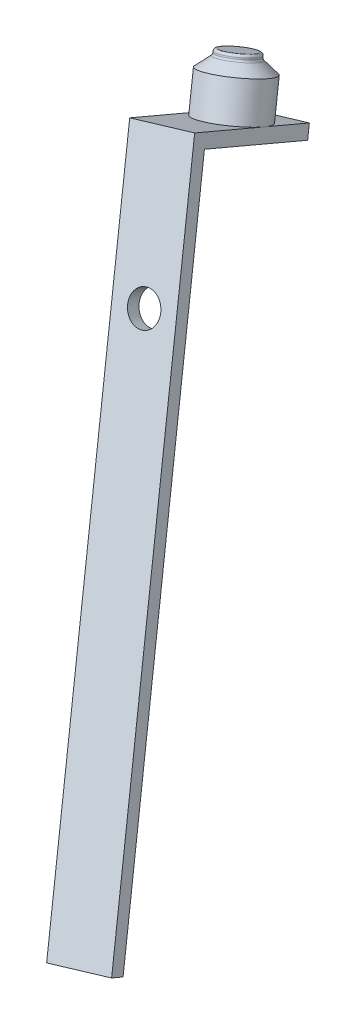
ISO-10303-21;
HEADER;
FILE_DESCRIPTION(('STEP AP214'),'2;1');
FILE_NAME('part.step','',(''),(''),'','','');
FILE_SCHEMA(('AUTOMOTIVE_DESIGN { 1 0 10303 214 1 1 1 1 }'));
ENDSEC;
DATA;
#1=APPLICATION_CONTEXT('core data for automotive mechanical design processes');
#2=APPLICATION_PROTOCOL_DEFINITION('international standard','automotive_design',2000,#1);
#3=PRODUCT_CONTEXT('',#1,'mechanical');
#4=PRODUCT('Part','Part','',(#3));
#5=PRODUCT_RELATED_PRODUCT_CATEGORY('part','',(#4));
#6=PRODUCT_DEFINITION_FORMATION('','',#4);
#7=PRODUCT_DEFINITION_CONTEXT('part definition',#1,'design');
#8=PRODUCT_DEFINITION('design','',#6,#7);
#9=PRODUCT_DEFINITION_SHAPE('','',#8);
#10=(LENGTH_UNIT() NAMED_UNIT(*) SI_UNIT(.MILLI.,.METRE.));
#11=(NAMED_UNIT(*) PLANE_ANGLE_UNIT() SI_UNIT($,.RADIAN.));
#12=(NAMED_UNIT(*) SI_UNIT($,.STERADIAN.) SOLID_ANGLE_UNIT());
#13=UNCERTAINTY_MEASURE_WITH_UNIT(LENGTH_MEASURE(1.E-05),#10,'distance_accuracy_value','');
#14=(GEOMETRIC_REPRESENTATION_CONTEXT(3) GLOBAL_UNCERTAINTY_ASSIGNED_CONTEXT((#13)) GLOBAL_UNIT_ASSIGNED_CONTEXT((#10,
#11,#12)) REPRESENTATION_CONTEXT('',''));
#15=CARTESIAN_POINT('',(0.,0.,0.));
#16=DIRECTION('',(0.,0.,1.));
#17=DIRECTION('',(1.,0.,0.));
#18=AXIS2_PLACEMENT_3D('',#15,#16,#17);
#19=CARTESIAN_POINT('',(-9.87720756884579,-10.4522564494439,322.697255318714));
#20=DIRECTION('',(0.242446875001236,-0.893041299663537,0.379073541542265));
#21=DIRECTION('',(0.,-0.390731128489272,-0.920504853452441));
#22=AXIS2_PLACEMENT_3D('',#19,#20,#21);
#23=PLANE('',#22);
#24=CARTESIAN_POINT('',(-5.12733587041596,-14.0893165058083,311.090968127761));
#25=DIRECTION('',(0.242446875001236,-0.893041299663537,0.379073541542265));
#26=DIRECTION('',(0.,-0.390731128489272,-0.920504853452441));
#27=AXIS2_PLACEMENT_3D('',#24,#25,#26);
#28=CIRCLE('',#27,4.89594372995816);
#29=CARTESIAN_POINT('',(-9.87720756884607,-15.1819615269252,311.554768422282));
#30=VERTEX_POINT('',#29);
#31=CARTESIAN_POINT('',(-0.377464171985479,-12.9966714846916,310.62716783324));
#32=VERTEX_POINT('',#31);
#33=EDGE_CURVE('E171',#30,#32,#28,.F.);
#34=ORIENTED_EDGE('',*,*,#33,.F.);
#35=DIRECTION('',(0.,-0.390731128489272,-0.920504853452441));
#36=VECTOR('',#35,1.);
#37=CARTESIAN_POINT('',(-9.87720756884579,-10.4522564494439,322.697255318714));
#38=LINE('',#37,#36);
#39=CARTESIAN_POINT('',(-9.87720756884579,-10.4522564494439,322.697255318714));
#40=VERTEX_POINT('',#39);
#41=EDGE_CURVE('E165',#40,#30,#38,.T.);
#42=ORIENTED_EDGE('',*,*,#41,.F.);
#43=DIRECTION('',(-0.970164683340996,-0.223173525143017,0.0947315410679266));
#44=VECTOR('',#43,1.);
#45=CARTESIAN_POINT('',(-9.87720756884579,-10.4522564494439,322.697255318714));
#46=LINE('',#45,#44);
#47=CARTESIAN_POINT('',(-0.377464171985523,-8.26696640721067,321.769654729672));
#48=VERTEX_POINT('',#47);
#49=EDGE_CURVE('E68',#48,#40,#46,.T.);
#50=ORIENTED_EDGE('',*,*,#49,.F.);
#51=DIRECTION('',(0.,-0.390731128489272,-0.920504853452441));
#52=VECTOR('',#51,1.);
#53=CARTESIAN_POINT('',(-0.377464171985523,-8.26696640721067,321.769654729672));
#54=LINE('',#53,#52);
#55=EDGE_CURVE('E168',#48,#32,#54,.T.);
#56=ORIENTED_EDGE('',*,*,#55,.T.);
#57=EDGE_LOOP('',(#34,#42,#50,#56));
#58=FACE_BOUND('',#57,.T.);
#59=ADVANCED_FACE('F45',(#58),#23,.F.);
#60=CARTESIAN_POINT('',(-1.53843465905612E-12,113.687272840091,267.830430684381));
#61=DIRECTION('',(0.,0.390731128489272,0.920504853452441));
#62=DIRECTION('',(0.,-0.920504853452441,0.390731128489272));
#63=AXIS2_PLACEMENT_3D('',#60,#61,#62);
#64=PLANE('',#63);
#65=CARTESIAN_POINT('',(-1.74575689842299E-13,-29.0273665670101,328.40920101713));
#66=DIRECTION('',(0.,0.390731128489272,0.920504853452441));
#67=DIRECTION('',(0.,-0.920504853452441,0.390731128489272));
#68=AXIS2_PLACEMENT_3D('',#65,#66,#67);
#69=CIRCLE('',#68,2.49999999999998);
#70=CARTESIAN_POINT('',(-1.74575689842299E-13,-31.3286287006412,329.386028838353));
#71=VERTEX_POINT('',#70);
#72=EDGE_CURVE('E153',#71,#71,#69,.T.);
#73=ORIENTED_EDGE('',*,*,#72,.T.);
#74=EDGE_LOOP('',(#73));
#75=FACE_BOUND('',#74,.T.);
#76=DIRECTION('',(-0.970164683340997,-0.223173525143014,0.0947315410679266));
#77=VECTOR('',#76,1.);
#78=CARTESIAN_POINT('',(-9.39231381884331,-13.0198013057495,321.614392694893));
#79=LINE('',#78,#77);
#80=CARTESIAN_POINT('',(0.107429578016953,-10.8345112635163,320.686792105852));
#81=VERTEX_POINT('',#80);
#82=CARTESIAN_POINT('',(-9.39231381884331,-13.0198013057495,321.614392694893));
#83=VERTEX_POINT('',#82);
#84=EDGE_CURVE('E138',#81,#83,#79,.T.);
#85=ORIENTED_EDGE('',*,*,#84,.F.);
#86=DIRECTION('',(-0.242446875001238,0.893041299663537,-0.379073541542265));
#87=VECTOR('',#86,1.);
#88=CARTESIAN_POINT('',(16.4923000593206,-71.1873866279333,346.305067783884));
#89=LINE('',#88,#87);
#90=CARTESIAN_POINT('',(23.2808125593553,-96.1925430185123,356.919126947067));
#91=VERTEX_POINT('',#90);
#92=EDGE_CURVE('E117',#91,#81,#89,.T.);
#93=ORIENTED_EDGE('',*,*,#92,.F.);
#94=DIRECTION('',(0.970164683340995,0.223173525143022,-0.094731541067921));
#95=VECTOR('',#94,1.);
#96=CARTESIAN_POINT('',(13.781069162495,-98.3778330607456,357.846727536109));
#97=LINE('',#96,#95);
#98=CARTESIAN_POINT('',(13.781069162495,-98.3778330607456,357.846727536109));
#99=VERTEX_POINT('',#98);
#100=EDGE_CURVE('E121',#99,#91,#97,.T.);
#101=ORIENTED_EDGE('',*,*,#100,.F.);
#102=DIRECTION('',(0.242446875001238,-0.893041299663537,0.379073541542265));
#103=VECTOR('',#102,1.);
#104=CARTESIAN_POINT('',(-9.87720756884578,-11.2337187064224,320.856245611809));
#105=LINE('',#104,#103);
#106=EDGE_CURVE('E106',#83,#99,#105,.T.);
#107=ORIENTED_EDGE('',*,*,#106,.F.);
#108=EDGE_LOOP('',(#85,#93,#101,#107));
#109=FACE_BOUND('',#108,.T.);
#110=ADVANCED_FACE('F122',(#75,#109),#64,.F.);
#111=CARTESIAN_POINT('',(-1.5454176217338E-12,114.46873509707,269.671440391286));
#112=DIRECTION('',(0.,0.390731128489272,0.920504853452441));
#113=DIRECTION('',(0.,-0.920504853452441,0.390731128489272));
#114=AXIS2_PLACEMENT_3D('',#111,#112,#113);
#115=PLANE('',#114);
#116=DIRECTION('',(0.242446875001238,-0.893041299663537,0.379073541542265));
#117=VECTOR('',#116,1.);
#118=CARTESIAN_POINT('',(-9.87720756884579,-10.4522564494439,322.697255318714));
#119=LINE('',#118,#117);
#120=CARTESIAN_POINT('',(13.781069162495,-97.596370803767,359.687737243014));
#121=VERTEX_POINT('',#120);
#122=EDGE_CURVE('E158',#40,#121,#119,.T.);
#123=ORIENTED_EDGE('',*,*,#122,.T.);
#124=DIRECTION('',(-0.970164683340995,-0.223173525143022,0.0947315410679209));
#125=VECTOR('',#124,1.);
#126=CARTESIAN_POINT('',(23.2808125593553,-95.4110807615338,358.760136653972));
#127=LINE('',#126,#125);
#128=CARTESIAN_POINT('',(23.2808125593553,-95.4110807615338,358.760136653972));
#129=VERTEX_POINT('',#128);
#130=EDGE_CURVE('E132',#129,#121,#127,.T.);
#131=ORIENTED_EDGE('',*,*,#130,.F.);
#132=DIRECTION('',(-0.242446875001238,0.893041299663537,-0.379073541542265));
#133=VECTOR('',#132,1.);
#134=CARTESIAN_POINT('',(16.4923000593206,-70.4059243709548,348.146077490789));
#135=LINE('',#134,#133);
#136=EDGE_CURVE('E160',#129,#48,#135,.T.);
#137=ORIENTED_EDGE('',*,*,#136,.T.);
#138=ORIENTED_EDGE('',*,*,#49,.T.);
#139=EDGE_LOOP('',(#123,#131,#137,#138));
#140=FACE_BOUND('',#139,.T.);
#141=CARTESIAN_POINT('',(-1.81558652519985E-13,-28.2459043100315,330.250210724035));
#142=DIRECTION('',(0.,0.390731128489272,0.920504853452441));
#143=DIRECTION('',(0.,-0.920504853452441,0.390731128489272));
#144=AXIS2_PLACEMENT_3D('',#141,#142,#143);
#145=CIRCLE('',#144,2.49999999999998);
#146=CARTESIAN_POINT('',(-1.81558652519985E-13,-30.5471664436626,331.227038545258));
#147=VERTEX_POINT('',#146);
#148=EDGE_CURVE('E118',#147,#147,#145,.T.);
#149=ORIENTED_EDGE('',*,*,#148,.F.);
#150=EDGE_LOOP('',(#149));
#151=FACE_BOUND('',#150,.T.);
#152=ADVANCED_FACE('F219',(#140,#151),#115,.T.);
#153=CARTESIAN_POINT('',(-9.87720756884579,-10.4522564494439,322.697255318714));
#154=DIRECTION('',(0.970164683340995,0.223173525143018,-0.094731541067928));
#155=DIRECTION('',(-0.224181702674668,0.974547363746825,0.));
#156=AXIS2_PLACEMENT_3D('',#153,#154,#155);
#157=PLANE('',#156);
#158=ORIENTED_EDGE('',*,*,#41,.T.);
#159=CARTESIAN_POINT('',(-9.87720756884573,-18.2668790192292,304.287158249665));
#160=VERTEX_POINT('',#159);
#161=EDGE_CURVE('E162',#30,#160,#38,.T.);
#162=ORIENTED_EDGE('',*,*,#161,.T.);
#163=DIRECTION('',(-0.24244687500123,0.893041299663542,-0.379073541542258));
#164=VECTOR('',#163,1.);
#165=CARTESIAN_POINT('',(-9.87720756884573,-18.2668790192292,304.287158249665));
#166=LINE('',#165,#164);
#167=CARTESIAN_POINT('',(-9.39231381884326,-20.0529616185563,305.045305332749));
#168=VERTEX_POINT('',#167);
#169=EDGE_CURVE('E139',#168,#160,#166,.T.);
#170=ORIENTED_EDGE('',*,*,#169,.F.);
#171=DIRECTION('',(0.,0.390731128489272,0.920504853452441));
#172=VECTOR('',#171,1.);
#173=CARTESIAN_POINT('',(-9.39231381884326,-20.0529616185563,305.045305332749));
#174=LINE('',#173,#172);
#175=EDGE_CURVE('E114',#168,#83,#174,.T.);
#176=ORIENTED_EDGE('',*,*,#175,.T.);
#177=ORIENTED_EDGE('',*,*,#106,.T.);
#178=DIRECTION('',(0.,-0.390731128489265,-0.920504853452444));
#179=VECTOR('',#178,1.);
#180=CARTESIAN_POINT('',(13.781069162495,-97.596370803767,359.687737243014));
#181=LINE('',#180,#179);
#182=EDGE_CURVE('E111',#121,#99,#181,.T.);
#183=ORIENTED_EDGE('',*,*,#182,.F.);
#184=ORIENTED_EDGE('',*,*,#122,.F.);
#185=EDGE_LOOP('',(#158,#162,#170,#176,#177,#183,#184));
#186=FACE_BOUND('',#185,.T.);
#187=ADVANCED_FACE('F108',(#186),#157,.F.);
#188=CARTESIAN_POINT('',(16.4923000593206,-70.4059243709548,348.146077490789));
#189=DIRECTION('',(-0.970164683340996,-0.223173525143018,0.094731541067928));
#190=DIRECTION('',(0.224181702674668,-0.974547363746825,0.));
#191=AXIS2_PLACEMENT_3D('',#188,#189,#190);
#192=PLANE('',#191);
#193=ORIENTED_EDGE('',*,*,#92,.T.);
#194=DIRECTION('',(0.,0.390731128489272,0.920504853452441));
#195=VECTOR('',#194,1.);
#196=CARTESIAN_POINT('',(0.107429578017007,-17.8676715763232,304.117704743708));
#197=LINE('',#196,#195);
#198=CARTESIAN_POINT('',(0.107429578017007,-17.8676715763232,304.117704743708));
#199=VERTEX_POINT('',#198);
#200=EDGE_CURVE('E151',#199,#81,#197,.T.);
#201=ORIENTED_EDGE('',*,*,#200,.F.);
#202=DIRECTION('',(0.242446875001225,-0.893041299663535,0.379073541542276));
#203=VECTOR('',#202,1.);
#204=CARTESIAN_POINT('',(-0.377464171985462,-16.081588976996,303.359557660623));
#205=LINE('',#204,#203);
#206=CARTESIAN_POINT('',(-0.377464171985462,-16.081588976996,303.359557660623));
#207=VERTEX_POINT('',#206);
#208=EDGE_CURVE('E145',#207,#199,#205,.T.);
#209=ORIENTED_EDGE('',*,*,#208,.F.);
#210=EDGE_CURVE('E167',#32,#207,#54,.T.);
#211=ORIENTED_EDGE('',*,*,#210,.F.);
#212=ORIENTED_EDGE('',*,*,#55,.F.);
#213=ORIENTED_EDGE('',*,*,#136,.F.);
#214=DIRECTION('',(0.,0.390731128489265,0.920504853452444));
#215=VECTOR('',#214,1.);
#216=CARTESIAN_POINT('',(23.2808125593553,-96.1925430185123,356.919126947067));
#217=LINE('',#216,#215);
#218=EDGE_CURVE('E127',#91,#129,#217,.T.);
#219=ORIENTED_EDGE('',*,*,#218,.F.);
#220=EDGE_LOOP('',(#193,#201,#209,#211,#212,#213,#219));
#221=FACE_BOUND('',#220,.T.);
#222=ADVANCED_FACE('F226',(#221),#192,.F.);
#223=CARTESIAN_POINT('',(-5.12733587041588,-14.0893165058086,311.090968127761));
#224=DIRECTION('',(-0.242446875001238,0.893041299663537,-0.379073541542265));
#225=DIRECTION('',(0.,0.390731128489272,0.920504853452441));
#226=AXIS2_PLACEMENT_3D('',#223,#224,#225);
#227=CIRCLE('',#226,4.89594372995816);
#228=EDGE_CURVE('E60',#32,#30,#227,.T.);
#229=ORIENTED_EDGE('',*,*,#228,.F.);
#230=ORIENTED_EDGE('',*,*,#210,.T.);
#231=DIRECTION('',(0.970164683340996,0.223173525143016,-0.0947315410679322));
#232=VECTOR('',#231,1.);
#233=CARTESIAN_POINT('',(-9.87720756884573,-18.2668790192292,304.287158249665));
#234=LINE('',#233,#232);
#235=EDGE_CURVE('E142',#160,#207,#234,.T.);
#236=ORIENTED_EDGE('',*,*,#235,.F.);
#237=ORIENTED_EDGE('',*,*,#161,.F.);
#238=EDGE_LOOP('',(#229,#230,#236,#237));
#239=FACE_BOUND('',#238,.T.);
#240=ADVANCED_FACE('F213',(#239),#23,.F.);
#241=CARTESIAN_POINT('',(-1.81558652519985E-13,-28.2459043100315,330.250210724035));
#242=DIRECTION('',(0.,-0.390731128489272,-0.920504853452441));
#243=DIRECTION('',(0.,0.920504853452441,-0.390731128489272));
#244=AXIS2_PLACEMENT_3D('',#241,#242,#243);
#245=CYLINDRICAL_SURFACE('',#244,2.49999999999998);
#246=ORIENTED_EDGE('',*,*,#148,.T.);
#247=EDGE_LOOP('',(#246));
#248=FACE_BOUND('',#247,.T.);
#249=ORIENTED_EDGE('',*,*,#72,.F.);
#250=EDGE_LOOP('',(#249));
#251=FACE_BOUND('',#250,.T.);
#252=ADVANCED_FACE('F225',(#248,#251),#245,.F.);
#253=CARTESIAN_POINT('',(-9.39231381884326,-20.0529616185563,305.045305332749));
#254=DIRECTION('',(-0.242446875001233,0.893041299663538,-0.379073541542265));
#255=DIRECTION('',(0.,0.390731128489273,0.920504853452441));
#256=AXIS2_PLACEMENT_3D('',#253,#254,#255);
#257=PLANE('',#256);
#258=ORIENTED_EDGE('',*,*,#84,.T.);
#259=ORIENTED_EDGE('',*,*,#175,.F.);
#260=DIRECTION('',(-0.970164683340997,-0.223173525143014,0.0947315410679266));
#261=VECTOR('',#260,1.);
#262=CARTESIAN_POINT('',(-9.39231381884326,-20.0529616185563,305.045305332749));
#263=LINE('',#262,#261);
#264=EDGE_CURVE('E147',#199,#168,#263,.T.);
#265=ORIENTED_EDGE('',*,*,#264,.F.);
#266=ORIENTED_EDGE('',*,*,#200,.T.);
#267=EDGE_LOOP('',(#258,#259,#265,#266));
#268=FACE_BOUND('',#267,.T.);
#269=ADVANCED_FACE('F231',(#268),#257,.F.);
#270=CARTESIAN_POINT('',(-2.16331739186877E-13,106.654112527283,251.261343322239));
#271=DIRECTION('',(0.,0.390731128489264,0.920504853452445));
#272=DIRECTION('',(0.,-0.920504853452445,0.390731128489264));
#273=AXIS2_PLACEMENT_3D('',#270,#271,#272);
#274=PLANE('',#273);
#275=ORIENTED_EDGE('',*,*,#169,.T.);
#276=ORIENTED_EDGE('',*,*,#235,.T.);
#277=ORIENTED_EDGE('',*,*,#208,.T.);
#278=ORIENTED_EDGE('',*,*,#264,.T.);
#279=EDGE_LOOP('',(#275,#276,#277,#278));
#280=FACE_BOUND('',#279,.T.);
#281=ADVANCED_FACE('F251',(#280),#274,.F.);
#282=CARTESIAN_POINT('',(-7.06691087042579,-6.94498610850028,308.058379795423));
#283=DIRECTION('',(0.242446875001238,-0.893041299663537,0.379073541542265));
#284=DIRECTION('',(0.,-0.390731128489272,-0.920504853452441));
#285=AXIS2_PLACEMENT_3D('',#282,#283,#284);
#286=CYLINDRICAL_SURFACE('',#285,4.89594372995816);
#287=CARTESIAN_POINT('',(-6.47900531153917,-9.11050770734475,308.97758917809));
#288=DIRECTION('',(-0.242446875001238,0.893041299663537,-0.379073541542265));
#289=DIRECTION('',(0.,0.390731128489272,0.920504853452441));
#290=AXIS2_PLACEMENT_3D('',#287,#288,#289);
#291=CIRCLE('',#290,4.89594372995816);
#292=CARTESIAN_POINT('',(-6.47900531153917,-7.19751008871822,313.484329143747));
#293=VERTEX_POINT('',#292);
#294=EDGE_CURVE('E174',#293,#293,#291,.F.);
#295=ORIENTED_EDGE('',*,*,#294,.T.);
#296=EDGE_LOOP('',(#295));
#297=FACE_BOUND('',#296,.T.);
#298=ORIENTED_EDGE('',*,*,#228,.T.);
#299=ORIENTED_EDGE('',*,*,#33,.T.);
#300=EDGE_LOOP('',(#298,#299));
#301=FACE_BOUND('',#300,.T.);
#302=ADVANCED_FACE('F246',(#297,#301),#286,.T.);
#303=CARTESIAN_POINT('',(-7.06691087042579,-6.94498610850028,308.058379795423));
#304=DIRECTION('',(0.242446875001238,-0.893041299663537,0.379073541542265));
#305=DIRECTION('',(0.,-0.390731128489272,-0.920504853452441));
#306=AXIS2_PLACEMENT_3D('',#303,#304,#305);
#307=CONICAL_SURFACE('',#306,1.86594372995816,0.895877505048691);
#308=CARTESIAN_POINT('',(-6.84376550931287,-7.76693121833579,308.407274794855));
#309=DIRECTION('',(0.242446875001238,-0.893041299663537,0.379073541542265));
#310=DIRECTION('',(0.,-0.390731128489272,-0.920504853452441));
#311=AXIS2_PLACEMENT_3D('',#308,#309,#310);
#312=CIRCLE('',#311,3.01601015466181);
#313=CARTESIAN_POINT('',(-6.84376550931287,-8.94538026960191,305.631022809427));
#314=VERTEX_POINT('',#313);
#315=EDGE_CURVE('E53',#314,#314,#312,.T.);
#316=ORIENTED_EDGE('',*,*,#315,.T.);
#317=EDGE_LOOP('',(#316));
#318=FACE_BOUND('',#317,.T.);
#319=ORIENTED_EDGE('',*,*,#294,.F.);
#320=EDGE_LOOP('',(#319));
#321=FACE_BOUND('',#320,.T.);
#322=ADVANCED_FACE('F185',(#318,#321),#307,.T.);
#323=CARTESIAN_POINT('',(-6.82446399542455,-7.83802740816383,308.437453336965));
#324=DIRECTION('',(-0.242446875001238,0.893041299663537,-0.379073541542265));
#325=DIRECTION('',(0.,0.390731128489272,0.920504853452441));
#326=AXIS2_PLACEMENT_3D('',#323,#324,#325);
#327=CYLINDRICAL_SURFACE('',#326,2.86594372995845);
#328=CARTESIAN_POINT('',(-6.91948241284603,-7.48803167823075,308.288888963828));
#329=DIRECTION('',(-0.242446875001238,0.893041299663537,-0.379073541542264));
#330=DIRECTION('',(0.,0.390731128489272,0.920504853452441));
#331=AXIS2_PLACEMENT_3D('',#328,#329,#330);
#332=CIRCLE('',#331,2.86594372995845);
#333=CARTESIAN_POINT('',(-6.91948241284603,-6.36821825043733,310.927004076976));
#334=VERTEX_POINT('',#333);
#335=EDGE_CURVE('E180',#334,#334,#332,.T.);
#336=ORIENTED_EDGE('',*,*,#335,.T.);
#337=EDGE_LOOP('',(#336));
#338=FACE_BOUND('',#337,.T.);
#339=CARTESIAN_POINT('',(-6.9699321204253,-7.30220262836566,308.21000921204));
#340=DIRECTION('',(-0.242446875001238,0.893041299663537,-0.379073541542265));
#341=DIRECTION('',(0.,0.390731128489272,0.920504853452441));
#342=AXIS2_PLACEMENT_3D('',#339,#340,#341);
#343=CIRCLE('',#342,2.86594372995845);
#344=CARTESIAN_POINT('',(-6.9699321204253,-6.18238920057224,310.848124325188));
#345=VERTEX_POINT('',#344);
#346=EDGE_CURVE('E177',#345,#345,#343,.F.);
#347=ORIENTED_EDGE('',*,*,#346,.T.);
#348=EDGE_LOOP('',(#347));
#349=FACE_BOUND('',#348,.T.);
#350=ADVANCED_FACE('F194',(#338,#349),#327,.T.);
#351=CARTESIAN_POINT('',(-7.06691087042579,-6.94498610850028,308.058379795423));
#352=DIRECTION('',(-0.242446875001238,0.893041299663537,-0.379073541542265));
#353=DIRECTION('',(0.,0.390731128489272,0.920504853452441));
#354=AXIS2_PLACEMENT_3D('',#351,#352,#353);
#355=PLANE('',#354);
#356=CARTESIAN_POINT('',(-7.0669108704258,-6.94498610850024,308.058379795423));
#357=DIRECTION('',(-0.242446875001238,0.893041299663537,-0.379073541542265));
#358=DIRECTION('',(0.,0.390731128489272,0.920504853452441));
#359=AXIS2_PLACEMENT_3D('',#356,#357,#358);
#360=CIRCLE('',#359,2.46594372995845);
#361=CARTESIAN_POINT('',(-7.0669108704258,-5.98146513210253,310.32829296719));
#362=VERTEX_POINT('',#361);
#363=EDGE_CURVE('E11',#362,#362,#360,.T.);
#364=ORIENTED_EDGE('',*,*,#363,.T.);
#365=EDGE_LOOP('',(#364));
#366=FACE_BOUND('',#365,.T.);
#367=ADVANCED_FACE('F191',(#366),#355,.T.);
#368=CARTESIAN_POINT('',(-6.91948241284602,-7.48803167823077,308.288888963828));
#369=DIRECTION('',(-0.242446875001238,0.893041299663537,-0.379073541542264));
#370=DIRECTION('',(0.,0.390731128489272,0.920504853452441));
#371=AXIS2_PLACEMENT_3D('',#368,#369,#370);
#372=TOROIDAL_SURFACE('',#371,3.2659437299585,0.4);
#373=ORIENTED_EDGE('',*,*,#315,.F.);
#374=EDGE_LOOP('',(#373));
#375=FACE_BOUND('',#374,.T.);
#376=ORIENTED_EDGE('',*,*,#335,.F.);
#377=EDGE_LOOP('',(#376));
#378=FACE_BOUND('',#377,.T.);
#379=ADVANCED_FACE('F188',(#375,#378),#372,.F.);
#380=CARTESIAN_POINT('',(-6.9699321204253,-7.30220262836566,308.21000921204));
#381=DIRECTION('',(-0.242446875001238,0.893041299663537,-0.379073541542265));
#382=DIRECTION('',(0.,0.390731128489272,0.920504853452441));
#383=AXIS2_PLACEMENT_3D('',#380,#381,#382);
#384=TOROIDAL_SURFACE('',#383,2.46594372995845,0.4);
#385=ORIENTED_EDGE('',*,*,#346,.F.);
#386=EDGE_LOOP('',(#385));
#387=FACE_BOUND('',#386,.T.);
#388=ORIENTED_EDGE('',*,*,#363,.F.);
#389=EDGE_LOOP('',(#388));
#390=FACE_BOUND('',#389,.T.);
#391=ADVANCED_FACE('F47',(#387,#390),#384,.T.);
#392=CARTESIAN_POINT('',(54.9983150707846,-202.583624845102,85.9916469231982));
#393=DIRECTION('',(0.242446875001239,-0.89304129966354,0.379073541542258));
#394=DIRECTION('',(0.,-0.390731128489266,-0.920504853452444));
#395=AXIS2_PLACEMENT_3D('',#392,#393,#394);
#396=PLANE('',#395);
#397=ORIENTED_EDGE('',*,*,#182,.T.);
#398=ORIENTED_EDGE('',*,*,#100,.T.);
#399=ORIENTED_EDGE('',*,*,#218,.T.);
#400=ORIENTED_EDGE('',*,*,#130,.T.);
#401=EDGE_LOOP('',(#397,#398,#399,#400));
#402=FACE_BOUND('',#401,.T.);
#403=ADVANCED_FACE('F130',(#402),#396,.T.);
#404=CLOSED_SHELL('',(#59,#110,#152,#187,#222,#240,#252,#269,#281,#302,#322,#350,#367,#379,#391,#403));
#405=MANIFOLD_SOLID_BREP('B2',#404);
#406=ADVANCED_BREP_SHAPE_REPRESENTATION('',(#18,#405),#14);
#407=SHAPE_DEFINITION_REPRESENTATION(#9,#406);
ENDSEC;
END-ISO-10303-21;
